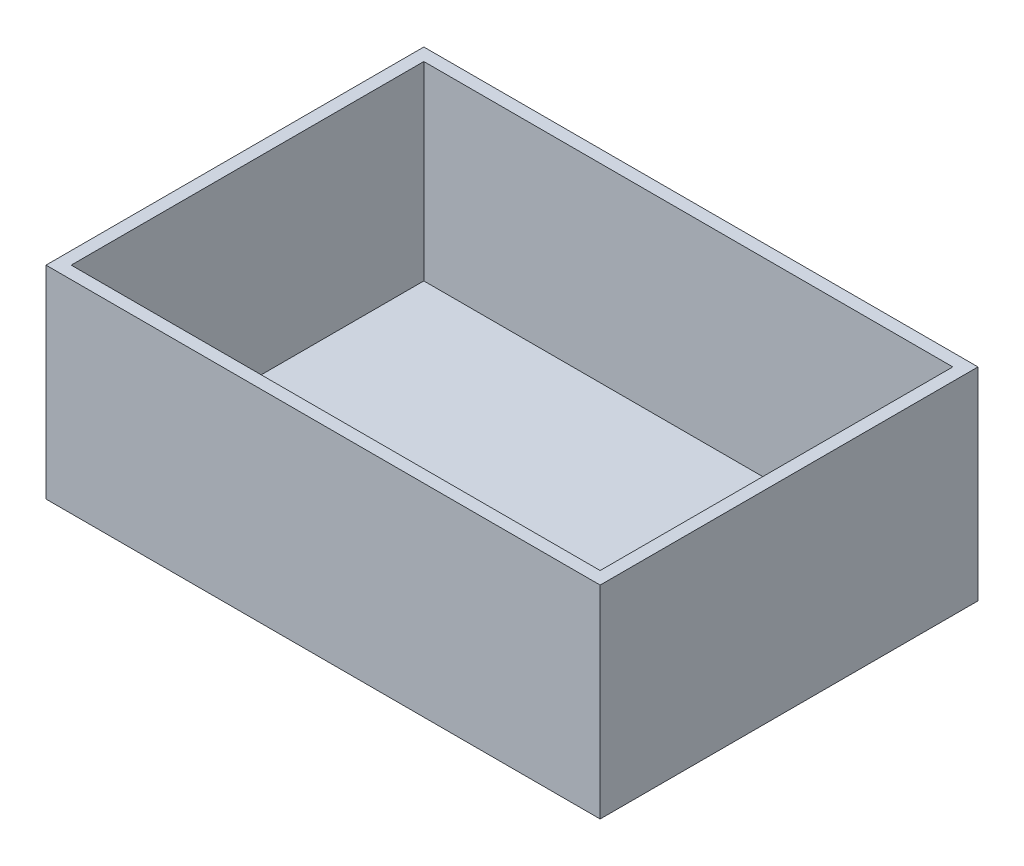
ISO-10303-21;
HEADER;
FILE_DESCRIPTION(('STEP AP214'),'2;1');
FILE_NAME('part.step','',(''),(''),'','','');
FILE_SCHEMA(('AUTOMOTIVE_DESIGN { 1 0 10303 214 1 1 1 1 }'));
ENDSEC;
DATA;
#1=APPLICATION_CONTEXT('core data for automotive mechanical design processes');
#2=APPLICATION_PROTOCOL_DEFINITION('international standard','automotive_design',2000,#1);
#3=PRODUCT_CONTEXT('',#1,'mechanical');
#4=PRODUCT('Part','Part','',(#3));
#5=PRODUCT_RELATED_PRODUCT_CATEGORY('part','',(#4));
#6=PRODUCT_DEFINITION_FORMATION('','',#4);
#7=PRODUCT_DEFINITION_CONTEXT('part definition',#1,'design');
#8=PRODUCT_DEFINITION('design','',#6,#7);
#9=PRODUCT_DEFINITION_SHAPE('','',#8);
#10=(LENGTH_UNIT() NAMED_UNIT(*) SI_UNIT(.MILLI.,.METRE.));
#11=(NAMED_UNIT(*) PLANE_ANGLE_UNIT() SI_UNIT($,.RADIAN.));
#12=(NAMED_UNIT(*) SI_UNIT($,.STERADIAN.) SOLID_ANGLE_UNIT());
#13=UNCERTAINTY_MEASURE_WITH_UNIT(LENGTH_MEASURE(1.E-05),#10,'distance_accuracy_value','');
#14=(GEOMETRIC_REPRESENTATION_CONTEXT(3) GLOBAL_UNCERTAINTY_ASSIGNED_CONTEXT((#13)) GLOBAL_UNIT_ASSIGNED_CONTEXT((#10,
#11,#12)) REPRESENTATION_CONTEXT('',''));
#15=CARTESIAN_POINT('',(0.,0.,0.));
#16=DIRECTION('',(0.,0.,1.));
#17=DIRECTION('',(1.,0.,0.));
#18=AXIS2_PLACEMENT_3D('',#15,#16,#17);
#19=CARTESIAN_POINT('',(69.85,3.175,47.625));
#20=DIRECTION('',(-1.,0.,0.));
#21=DIRECTION('',(0.,0.,1.));
#22=AXIS2_PLACEMENT_3D('',#19,#20,#21);
#23=PLANE('',#22);
#24=DIRECTION('',(0.,0.,-1.));
#25=VECTOR('',#24,1.);
#26=CARTESIAN_POINT('',(69.85,0.,47.625));
#27=LINE('',#26,#25);
#28=CARTESIAN_POINT('',(69.85,0.,47.625));
#29=VERTEX_POINT('',#28);
#30=CARTESIAN_POINT('',(69.85,0.,-47.625));
#31=VERTEX_POINT('',#30);
#32=EDGE_CURVE('E148',#29,#31,#27,.T.);
#33=ORIENTED_EDGE('',*,*,#32,.T.);
#34=DIRECTION('',(0.,-1.,0.));
#35=VECTOR('',#34,1.);
#36=CARTESIAN_POINT('',(69.85,3.175,-47.625));
#37=LINE('',#36,#35);
#38=CARTESIAN_POINT('',(69.85,51.0794,-47.625));
#39=VERTEX_POINT('',#38);
#40=EDGE_CURVE('E11',#39,#31,#37,.T.);
#41=ORIENTED_EDGE('',*,*,#40,.F.);
#42=DIRECTION('',(0.,0.,-1.));
#43=VECTOR('',#42,1.);
#44=CARTESIAN_POINT('',(69.85,51.0794,47.625));
#45=LINE('',#44,#43);
#46=CARTESIAN_POINT('',(69.85,51.0794,47.625));
#47=VERTEX_POINT('',#46);
#48=EDGE_CURVE('E139',#47,#39,#45,.T.);
#49=ORIENTED_EDGE('',*,*,#48,.F.);
#50=DIRECTION('',(0.,-1.,0.));
#51=VECTOR('',#50,1.);
#52=CARTESIAN_POINT('',(69.85,3.175,47.625));
#53=LINE('',#52,#51);
#54=EDGE_CURVE('E156',#47,#29,#53,.T.);
#55=ORIENTED_EDGE('',*,*,#54,.T.);
#56=EDGE_LOOP('',(#33,#41,#49,#55));
#57=FACE_BOUND('',#56,.T.);
#58=ADVANCED_FACE('F31',(#57),#23,.F.);
#59=CARTESIAN_POINT('',(-69.85,3.175,-47.625));
#60=DIRECTION('',(0.,0.,1.));
#61=DIRECTION('',(1.,0.,0.));
#62=AXIS2_PLACEMENT_3D('',#59,#60,#61);
#63=PLANE('',#62);
#64=DIRECTION('',(-1.,0.,0.));
#65=VECTOR('',#64,1.);
#66=CARTESIAN_POINT('',(-69.85,0.,-47.625));
#67=LINE('',#66,#65);
#68=CARTESIAN_POINT('',(-69.85,0.,-47.625));
#69=VERTEX_POINT('',#68);
#70=EDGE_CURVE('E151',#31,#69,#67,.T.);
#71=ORIENTED_EDGE('',*,*,#70,.T.);
#72=DIRECTION('',(0.,-1.,0.));
#73=VECTOR('',#72,1.);
#74=CARTESIAN_POINT('',(-69.85,3.175,-47.625));
#75=LINE('',#74,#73);
#76=CARTESIAN_POINT('',(-69.85,51.0794,-47.625));
#77=VERTEX_POINT('',#76);
#78=EDGE_CURVE('E38',#77,#69,#75,.T.);
#79=ORIENTED_EDGE('',*,*,#78,.F.);
#80=DIRECTION('',(-1.,0.,0.));
#81=VECTOR('',#80,1.);
#82=CARTESIAN_POINT('',(69.85,51.0794,-47.625));
#83=LINE('',#82,#81);
#84=EDGE_CURVE('E142',#39,#77,#83,.T.);
#85=ORIENTED_EDGE('',*,*,#84,.F.);
#86=ORIENTED_EDGE('',*,*,#40,.T.);
#87=EDGE_LOOP('',(#71,#79,#85,#86));
#88=FACE_BOUND('',#87,.T.);
#89=ADVANCED_FACE('F174',(#88),#63,.F.);
#90=CARTESIAN_POINT('',(-69.85,3.175,47.625));
#91=DIRECTION('',(1.,0.,0.));
#92=DIRECTION('',(0.,0.,-1.));
#93=AXIS2_PLACEMENT_3D('',#90,#91,#92);
#94=PLANE('',#93);
#95=DIRECTION('',(0.,0.,1.));
#96=VECTOR('',#95,1.);
#97=CARTESIAN_POINT('',(-69.85,0.,47.625));
#98=LINE('',#97,#96);
#99=CARTESIAN_POINT('',(-69.85,0.,47.625));
#100=VERTEX_POINT('',#99);
#101=EDGE_CURVE('E153',#69,#100,#98,.T.);
#102=ORIENTED_EDGE('',*,*,#101,.T.);
#103=DIRECTION('',(0.,-1.,0.));
#104=VECTOR('',#103,1.);
#105=CARTESIAN_POINT('',(-69.85,3.175,47.625));
#106=LINE('',#105,#104);
#107=CARTESIAN_POINT('',(-69.85,51.0794,47.625));
#108=VERTEX_POINT('',#107);
#109=EDGE_CURVE('E158',#108,#100,#106,.T.);
#110=ORIENTED_EDGE('',*,*,#109,.F.);
#111=DIRECTION('',(0.,0.,1.));
#112=VECTOR('',#111,1.);
#113=CARTESIAN_POINT('',(-69.85,51.0794,-47.625));
#114=LINE('',#113,#112);
#115=EDGE_CURVE('E145',#77,#108,#114,.T.);
#116=ORIENTED_EDGE('',*,*,#115,.F.);
#117=ORIENTED_EDGE('',*,*,#78,.T.);
#118=EDGE_LOOP('',(#102,#110,#116,#117));
#119=FACE_BOUND('',#118,.T.);
#120=ADVANCED_FACE('F163',(#119),#94,.F.);
#121=CARTESIAN_POINT('',(-69.85,3.175,47.625));
#122=DIRECTION('',(0.,0.,-1.));
#123=DIRECTION('',(-1.,0.,0.));
#124=AXIS2_PLACEMENT_3D('',#121,#122,#123);
#125=PLANE('',#124);
#126=DIRECTION('',(1.,0.,0.));
#127=VECTOR('',#126,1.);
#128=CARTESIAN_POINT('',(-69.85,0.,47.625));
#129=LINE('',#128,#127);
#130=EDGE_CURVE('E53',#100,#29,#129,.T.);
#131=ORIENTED_EDGE('',*,*,#130,.T.);
#132=ORIENTED_EDGE('',*,*,#54,.F.);
#133=DIRECTION('',(1.,0.,0.));
#134=VECTOR('',#133,1.);
#135=CARTESIAN_POINT('',(-69.85,51.0794,47.625));
#136=LINE('',#135,#134);
#137=EDGE_CURVE('E113',#108,#47,#136,.T.);
#138=ORIENTED_EDGE('',*,*,#137,.F.);
#139=ORIENTED_EDGE('',*,*,#109,.T.);
#140=EDGE_LOOP('',(#131,#132,#138,#139));
#141=FACE_BOUND('',#140,.T.);
#142=ADVANCED_FACE('F172',(#141),#125,.F.);
#143=CARTESIAN_POINT('',(69.85,0.,-47.625));
#144=DIRECTION('',(0.,-1.,0.));
#145=DIRECTION('',(0.,0.,-1.));
#146=AXIS2_PLACEMENT_3D('',#143,#144,#145);
#147=PLANE('',#146);
#148=ORIENTED_EDGE('',*,*,#32,.F.);
#149=ORIENTED_EDGE('',*,*,#130,.F.);
#150=ORIENTED_EDGE('',*,*,#101,.F.);
#151=ORIENTED_EDGE('',*,*,#70,.F.);
#152=EDGE_LOOP('',(#148,#149,#150,#151));
#153=FACE_BOUND('',#152,.T.);
#154=ADVANCED_FACE('F168',(#153),#147,.T.);
#155=CARTESIAN_POINT('',(69.85,51.0794,47.625));
#156=DIRECTION('',(0.,1.,0.));
#157=DIRECTION('',(0.,0.,1.));
#158=AXIS2_PLACEMENT_3D('',#155,#156,#157);
#159=PLANE('',#158);
#160=ORIENTED_EDGE('',*,*,#137,.T.);
#161=ORIENTED_EDGE('',*,*,#48,.T.);
#162=ORIENTED_EDGE('',*,*,#84,.T.);
#163=ORIENTED_EDGE('',*,*,#115,.T.);
#164=EDGE_LOOP('',(#160,#161,#162,#163));
#165=FACE_BOUND('',#164,.T.);
#166=DIRECTION('',(0.,0.,-1.));
#167=VECTOR('',#166,1.);
#168=CARTESIAN_POINT('',(66.675,51.0794,44.45));
#169=LINE('',#168,#167);
#170=CARTESIAN_POINT('',(66.675,51.0794,44.45));
#171=VERTEX_POINT('',#170);
#172=CARTESIAN_POINT('',(66.675,51.0794,-44.45));
#173=VERTEX_POINT('',#172);
#174=EDGE_CURVE('E105',#171,#173,#169,.T.);
#175=ORIENTED_EDGE('',*,*,#174,.F.);
#176=DIRECTION('',(1.,0.,0.));
#177=VECTOR('',#176,1.);
#178=CARTESIAN_POINT('',(-66.675,51.0794,44.45));
#179=LINE('',#178,#177);
#180=CARTESIAN_POINT('',(-66.675,51.0794,44.45));
#181=VERTEX_POINT('',#180);
#182=EDGE_CURVE('E97',#181,#171,#179,.T.);
#183=ORIENTED_EDGE('',*,*,#182,.F.);
#184=DIRECTION('',(0.,0.,1.));
#185=VECTOR('',#184,1.);
#186=CARTESIAN_POINT('',(-66.675,51.0794,-44.45));
#187=LINE('',#186,#185);
#188=CARTESIAN_POINT('',(-66.675,51.0794,-44.45));
#189=VERTEX_POINT('',#188);
#190=EDGE_CURVE('E121',#189,#181,#187,.T.);
#191=ORIENTED_EDGE('',*,*,#190,.F.);
#192=DIRECTION('',(-1.,0.,0.));
#193=VECTOR('',#192,1.);
#194=CARTESIAN_POINT('',(66.675,51.0794,-44.45));
#195=LINE('',#194,#193);
#196=EDGE_CURVE('E119',#173,#189,#195,.T.);
#197=ORIENTED_EDGE('',*,*,#196,.F.);
#198=EDGE_LOOP('',(#175,#183,#191,#197));
#199=FACE_BOUND('',#198,.T.);
#200=ADVANCED_FACE('F117',(#165,#199),#159,.T.);
#201=CARTESIAN_POINT('',(-66.675,51.0794,44.45));
#202=DIRECTION('',(0.,0.,-1.));
#203=DIRECTION('',(-1.,0.,0.));
#204=AXIS2_PLACEMENT_3D('',#201,#202,#203);
#205=PLANE('',#204);
#206=DIRECTION('',(1.,0.,0.));
#207=VECTOR('',#206,1.);
#208=CARTESIAN_POINT('',(-66.675,3.175,44.45));
#209=LINE('',#208,#207);
#210=CARTESIAN_POINT('',(-66.675,3.175,44.45));
#211=VERTEX_POINT('',#210);
#212=CARTESIAN_POINT('',(66.675,3.175,44.45));
#213=VERTEX_POINT('',#212);
#214=EDGE_CURVE('E125',#211,#213,#209,.T.);
#215=ORIENTED_EDGE('',*,*,#214,.F.);
#216=DIRECTION('',(0.,-1.,0.));
#217=VECTOR('',#216,1.);
#218=CARTESIAN_POINT('',(-66.675,51.0794,44.45));
#219=LINE('',#218,#217);
#220=EDGE_CURVE('E45',#181,#211,#219,.T.);
#221=ORIENTED_EDGE('',*,*,#220,.F.);
#222=ORIENTED_EDGE('',*,*,#182,.T.);
#223=DIRECTION('',(0.,-1.,0.));
#224=VECTOR('',#223,1.);
#225=CARTESIAN_POINT('',(66.675,51.0794,44.45));
#226=LINE('',#225,#224);
#227=EDGE_CURVE('E100',#171,#213,#226,.T.);
#228=ORIENTED_EDGE('',*,*,#227,.T.);
#229=EDGE_LOOP('',(#215,#221,#222,#228));
#230=FACE_BOUND('',#229,.T.);
#231=ADVANCED_FACE('F99',(#230),#205,.T.);
#232=CARTESIAN_POINT('',(66.675,51.0794,44.45));
#233=DIRECTION('',(-1.,0.,0.));
#234=DIRECTION('',(0.,0.,1.));
#235=AXIS2_PLACEMENT_3D('',#232,#233,#234);
#236=PLANE('',#235);
#237=DIRECTION('',(0.,0.,-1.));
#238=VECTOR('',#237,1.);
#239=CARTESIAN_POINT('',(66.675,3.175,44.45));
#240=LINE('',#239,#238);
#241=CARTESIAN_POINT('',(66.675,3.175,-44.45));
#242=VERTEX_POINT('',#241);
#243=EDGE_CURVE('E112',#213,#242,#240,.T.);
#244=ORIENTED_EDGE('',*,*,#243,.F.);
#245=ORIENTED_EDGE('',*,*,#227,.F.);
#246=ORIENTED_EDGE('',*,*,#174,.T.);
#247=DIRECTION('',(0.,-1.,0.));
#248=VECTOR('',#247,1.);
#249=CARTESIAN_POINT('',(66.675,51.0794,-44.45));
#250=LINE('',#249,#248);
#251=EDGE_CURVE('E114',#173,#242,#250,.T.);
#252=ORIENTED_EDGE('',*,*,#251,.T.);
#253=EDGE_LOOP('',(#244,#245,#246,#252));
#254=FACE_BOUND('',#253,.T.);
#255=ADVANCED_FACE('F109',(#254),#236,.T.);
#256=CARTESIAN_POINT('',(66.675,51.0794,-44.45));
#257=DIRECTION('',(0.,0.,1.));
#258=DIRECTION('',(1.,0.,0.));
#259=AXIS2_PLACEMENT_3D('',#256,#257,#258);
#260=PLANE('',#259);
#261=DIRECTION('',(-1.,0.,0.));
#262=VECTOR('',#261,1.);
#263=CARTESIAN_POINT('',(66.675,3.175,-44.45));
#264=LINE('',#263,#262);
#265=CARTESIAN_POINT('',(-66.675,3.175,-44.45));
#266=VERTEX_POINT('',#265);
#267=EDGE_CURVE('E128',#242,#266,#264,.T.);
#268=ORIENTED_EDGE('',*,*,#267,.F.);
#269=ORIENTED_EDGE('',*,*,#251,.F.);
#270=ORIENTED_EDGE('',*,*,#196,.T.);
#271=DIRECTION('',(0.,-1.,0.));
#272=VECTOR('',#271,1.);
#273=CARTESIAN_POINT('',(-66.675,51.0794,-44.45));
#274=LINE('',#273,#272);
#275=EDGE_CURVE('E134',#189,#266,#274,.T.);
#276=ORIENTED_EDGE('',*,*,#275,.T.);
#277=EDGE_LOOP('',(#268,#269,#270,#276));
#278=FACE_BOUND('',#277,.T.);
#279=ADVANCED_FACE('F197',(#278),#260,.T.);
#280=CARTESIAN_POINT('',(-66.675,51.0794,-44.45));
#281=DIRECTION('',(1.,0.,0.));
#282=DIRECTION('',(0.,0.,-1.));
#283=AXIS2_PLACEMENT_3D('',#280,#281,#282);
#284=PLANE('',#283);
#285=DIRECTION('',(0.,0.,1.));
#286=VECTOR('',#285,1.);
#287=CARTESIAN_POINT('',(-66.675,3.175,-44.45));
#288=LINE('',#287,#286);
#289=EDGE_CURVE('E106',#266,#211,#288,.T.);
#290=ORIENTED_EDGE('',*,*,#289,.F.);
#291=ORIENTED_EDGE('',*,*,#275,.F.);
#292=ORIENTED_EDGE('',*,*,#190,.T.);
#293=ORIENTED_EDGE('',*,*,#220,.T.);
#294=EDGE_LOOP('',(#290,#291,#292,#293));
#295=FACE_BOUND('',#294,.T.);
#296=ADVANCED_FACE('F189',(#295),#284,.T.);
#297=CARTESIAN_POINT('',(69.85,3.175,-47.625));
#298=DIRECTION('',(0.,-1.,0.));
#299=DIRECTION('',(0.,0.,-1.));
#300=AXIS2_PLACEMENT_3D('',#297,#298,#299);
#301=PLANE('',#300);
#302=ORIENTED_EDGE('',*,*,#289,.T.);
#303=ORIENTED_EDGE('',*,*,#214,.T.);
#304=ORIENTED_EDGE('',*,*,#243,.T.);
#305=ORIENTED_EDGE('',*,*,#267,.T.);
#306=EDGE_LOOP('',(#302,#303,#304,#305));
#307=FACE_BOUND('',#306,.T.);
#308=ADVANCED_FACE('F186',(#307),#301,.F.);
#309=CLOSED_SHELL('',(#58,#89,#120,#142,#154,#200,#231,#255,#279,#296,#308));
#310=MANIFOLD_SOLID_BREP('B2',#309);
#311=ADVANCED_BREP_SHAPE_REPRESENTATION('',(#18,#310),#14);
#312=SHAPE_DEFINITION_REPRESENTATION(#9,#311);
ENDSEC;
END-ISO-10303-21;
